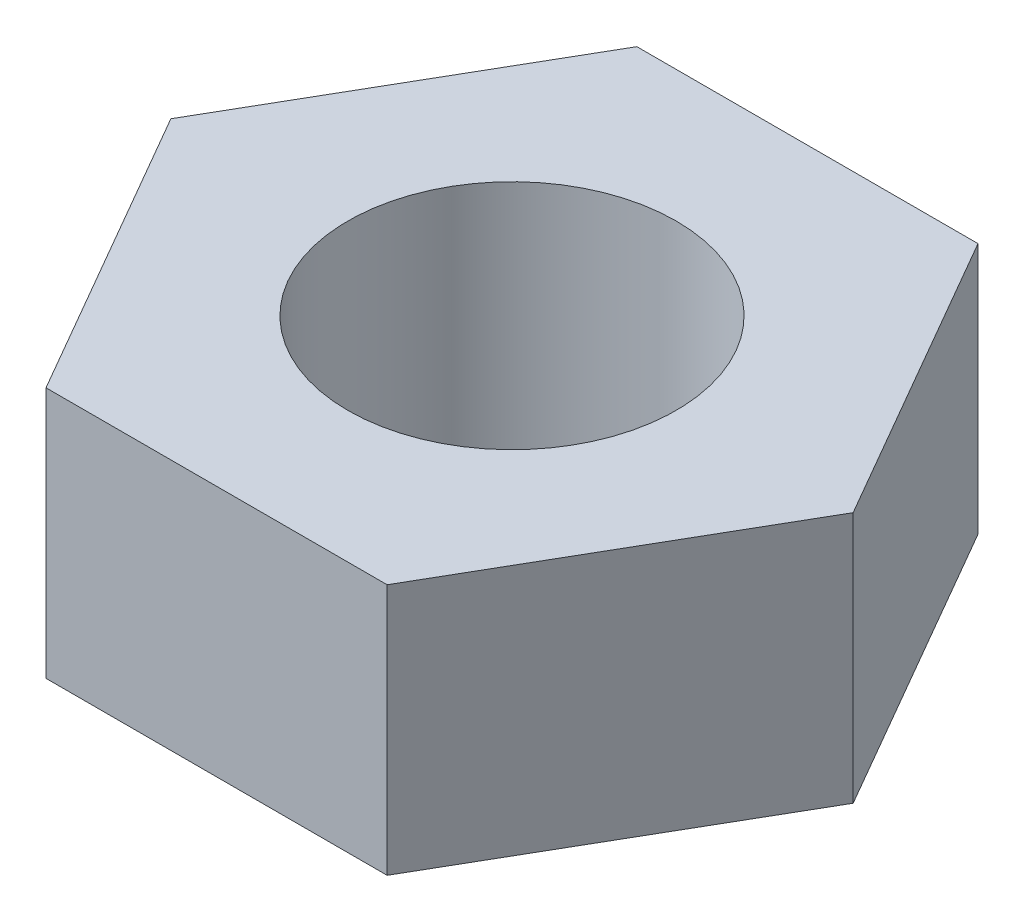
ISO-10303-21;
HEADER;
FILE_DESCRIPTION(('STEP AP214'),'2;1');
FILE_NAME('part.step','',(''),(''),'','','');
FILE_SCHEMA(('AUTOMOTIVE_DESIGN { 1 0 10303 214 1 1 1 1 }'));
ENDSEC;
DATA;
#1=APPLICATION_CONTEXT('core data for automotive mechanical design processes');
#2=APPLICATION_PROTOCOL_DEFINITION('international standard','automotive_design',2000,#1);
#3=PRODUCT_CONTEXT('',#1,'mechanical');
#4=PRODUCT('Part','Part','',(#3));
#5=PRODUCT_RELATED_PRODUCT_CATEGORY('part','',(#4));
#6=PRODUCT_DEFINITION_FORMATION('','',#4);
#7=PRODUCT_DEFINITION_CONTEXT('part definition',#1,'design');
#8=PRODUCT_DEFINITION('design','',#6,#7);
#9=PRODUCT_DEFINITION_SHAPE('','',#8);
#10=(LENGTH_UNIT() NAMED_UNIT(*) SI_UNIT(.MILLI.,.METRE.));
#11=(NAMED_UNIT(*) PLANE_ANGLE_UNIT() SI_UNIT($,.RADIAN.));
#12=(NAMED_UNIT(*) SI_UNIT($,.STERADIAN.) SOLID_ANGLE_UNIT());
#13=UNCERTAINTY_MEASURE_WITH_UNIT(LENGTH_MEASURE(1.E-05),#10,'distance_accuracy_value','');
#14=(GEOMETRIC_REPRESENTATION_CONTEXT(3) GLOBAL_UNCERTAINTY_ASSIGNED_CONTEXT((#13)) GLOBAL_UNIT_ASSIGNED_CONTEXT((#10,
#11,#12)) REPRESENTATION_CONTEXT('',''));
#15=CARTESIAN_POINT('',(0.,0.,0.));
#16=DIRECTION('',(0.,0.,1.));
#17=DIRECTION('',(1.,0.,0.));
#18=AXIS2_PLACEMENT_3D('',#15,#16,#17);
#19=CARTESIAN_POINT('',(0.,2.3,0.));
#20=DIRECTION('',(0.,1.,0.));
#21=DIRECTION('',(0.,0.,1.));
#22=AXIS2_PLACEMENT_3D('',#19,#20,#21);
#23=PLANE('',#22);
#24=DIRECTION('',(0.5,0.,-0.866025403784439));
#25=VECTOR('',#24,1.);
#26=CARTESIAN_POINT('',(1.55884572681199,2.3,2.7));
#27=LINE('',#26,#25);
#28=CARTESIAN_POINT('',(1.55884572681199,2.3,2.7));
#29=VERTEX_POINT('',#28);
#30=CARTESIAN_POINT('',(3.11769145362398,2.3,0.));
#31=VERTEX_POINT('',#30);
#32=EDGE_CURVE('E131',#29,#31,#27,.T.);
#33=ORIENTED_EDGE('',*,*,#32,.T.);
#34=DIRECTION('',(-0.5,0.,-0.866025403784439));
#35=VECTOR('',#34,1.);
#36=CARTESIAN_POINT('',(3.11769145362398,2.3,0.));
#37=LINE('',#36,#35);
#38=CARTESIAN_POINT('',(1.55884572681199,2.3,-2.70000000000001));
#39=VERTEX_POINT('',#38);
#40=EDGE_CURVE('E89',#31,#39,#37,.T.);
#41=ORIENTED_EDGE('',*,*,#40,.T.);
#42=DIRECTION('',(-1.,0.,0.));
#43=VECTOR('',#42,1.);
#44=CARTESIAN_POINT('',(1.55884572681199,2.3,-2.70000000000001));
#45=LINE('',#44,#43);
#46=CARTESIAN_POINT('',(-1.55884572681199,2.3,-2.70000000000001));
#47=VERTEX_POINT('',#46);
#48=EDGE_CURVE('E102',#39,#47,#45,.T.);
#49=ORIENTED_EDGE('',*,*,#48,.T.);
#50=DIRECTION('',(-0.5,0.,0.866025403784439));
#51=VECTOR('',#50,1.);
#52=CARTESIAN_POINT('',(-1.55884572681199,2.3,-2.70000000000001));
#53=LINE('',#52,#51);
#54=CARTESIAN_POINT('',(-3.11769145362398,2.3,0.));
#55=VERTEX_POINT('',#54);
#56=EDGE_CURVE('E96',#47,#55,#53,.T.);
#57=ORIENTED_EDGE('',*,*,#56,.T.);
#58=DIRECTION('',(0.5,0.,0.866025403784438));
#59=VECTOR('',#58,1.);
#60=CARTESIAN_POINT('',(-3.11769145362398,2.3,0.));
#61=LINE('',#60,#59);
#62=CARTESIAN_POINT('',(-1.55884572681199,2.3,2.7));
#63=VERTEX_POINT('',#62);
#64=EDGE_CURVE('E100',#55,#63,#61,.T.);
#65=ORIENTED_EDGE('',*,*,#64,.T.);
#66=DIRECTION('',(1.,0.,0.));
#67=VECTOR('',#66,1.);
#68=CARTESIAN_POINT('',(-1.55884572681199,2.3,2.7));
#69=LINE('',#68,#67);
#70=EDGE_CURVE('E52',#63,#29,#69,.T.);
#71=ORIENTED_EDGE('',*,*,#70,.T.);
#72=EDGE_LOOP('',(#33,#41,#49,#57,#65,#71));
#73=FACE_BOUND('',#72,.T.);
#74=CARTESIAN_POINT('',(0.,2.3,0.));
#75=DIRECTION('',(0.,1.,0.));
#76=DIRECTION('',(0.,0.,1.));
#77=AXIS2_PLACEMENT_3D('',#74,#75,#76);
#78=CIRCLE('',#77,1.5);
#79=CARTESIAN_POINT('',(0.,2.3,1.5));
#80=VERTEX_POINT('',#79);
#81=EDGE_CURVE('E124',#80,#80,#78,.T.);
#82=ORIENTED_EDGE('',*,*,#81,.F.);
#83=EDGE_LOOP('',(#82));
#84=FACE_BOUND('',#83,.T.);
#85=ADVANCED_FACE('F35',(#73,#84),#23,.T.);
#86=CARTESIAN_POINT('',(0.,0.,0.));
#87=DIRECTION('',(0.,1.,0.));
#88=DIRECTION('',(0.,0.,1.));
#89=AXIS2_PLACEMENT_3D('',#86,#87,#88);
#90=PLANE('',#89);
#91=DIRECTION('',(0.5,0.,-0.866025403784439));
#92=VECTOR('',#91,1.);
#93=CARTESIAN_POINT('',(1.55884572681199,0.,2.7));
#94=LINE('',#93,#92);
#95=CARTESIAN_POINT('',(1.55884572681199,0.,2.7));
#96=VERTEX_POINT('',#95);
#97=CARTESIAN_POINT('',(3.11769145362398,0.,0.));
#98=VERTEX_POINT('',#97);
#99=EDGE_CURVE('E120',#96,#98,#94,.T.);
#100=ORIENTED_EDGE('',*,*,#99,.F.);
#101=DIRECTION('',(1.,0.,0.));
#102=VECTOR('',#101,1.);
#103=CARTESIAN_POINT('',(-1.55884572681199,0.,2.7));
#104=LINE('',#103,#102);
#105=CARTESIAN_POINT('',(-1.55884572681199,0.,2.7));
#106=VERTEX_POINT('',#105);
#107=EDGE_CURVE('E81',#106,#96,#104,.T.);
#108=ORIENTED_EDGE('',*,*,#107,.F.);
#109=DIRECTION('',(0.5,0.,0.866025403784438));
#110=VECTOR('',#109,1.);
#111=CARTESIAN_POINT('',(-3.11769145362398,0.,0.));
#112=LINE('',#111,#110);
#113=CARTESIAN_POINT('',(-3.11769145362398,0.,0.));
#114=VERTEX_POINT('',#113);
#115=EDGE_CURVE('E75',#114,#106,#112,.T.);
#116=ORIENTED_EDGE('',*,*,#115,.F.);
#117=DIRECTION('',(-0.5,0.,0.866025403784439));
#118=VECTOR('',#117,1.);
#119=CARTESIAN_POINT('',(-1.55884572681199,0.,-2.70000000000001));
#120=LINE('',#119,#118);
#121=CARTESIAN_POINT('',(-1.55884572681199,0.,-2.70000000000001));
#122=VERTEX_POINT('',#121);
#123=EDGE_CURVE('E110',#122,#114,#120,.T.);
#124=ORIENTED_EDGE('',*,*,#123,.F.);
#125=DIRECTION('',(-1.,0.,0.));
#126=VECTOR('',#125,1.);
#127=CARTESIAN_POINT('',(1.55884572681199,0.,-2.70000000000001));
#128=LINE('',#127,#126);
#129=CARTESIAN_POINT('',(1.55884572681199,0.,-2.70000000000001));
#130=VERTEX_POINT('',#129);
#131=EDGE_CURVE('E126',#130,#122,#128,.T.);
#132=ORIENTED_EDGE('',*,*,#131,.F.);
#133=DIRECTION('',(-0.5,0.,-0.866025403784439));
#134=VECTOR('',#133,1.);
#135=CARTESIAN_POINT('',(3.11769145362398,0.,0.));
#136=LINE('',#135,#134);
#137=EDGE_CURVE('E123',#98,#130,#136,.T.);
#138=ORIENTED_EDGE('',*,*,#137,.F.);
#139=EDGE_LOOP('',(#100,#108,#116,#124,#132,#138));
#140=FACE_BOUND('',#139,.T.);
#141=CARTESIAN_POINT('',(0.,0.,0.));
#142=DIRECTION('',(0.,1.,0.));
#143=DIRECTION('',(0.,0.,1.));
#144=AXIS2_PLACEMENT_3D('',#141,#142,#143);
#145=CIRCLE('',#144,1.5);
#146=CARTESIAN_POINT('',(0.,0.,1.5));
#147=VERTEX_POINT('',#146);
#148=EDGE_CURVE('E224',#147,#147,#145,.T.);
#149=ORIENTED_EDGE('',*,*,#148,.T.);
#150=EDGE_LOOP('',(#149));
#151=FACE_BOUND('',#150,.T.);
#152=ADVANCED_FACE('F140',(#140,#151),#90,.F.);
#153=CARTESIAN_POINT('',(1.55884572681199,2.3,2.7));
#154=DIRECTION('',(-0.866025403784439,0.,-0.5));
#155=DIRECTION('',(-0.5,0.,0.866025403784439));
#156=AXIS2_PLACEMENT_3D('',#153,#154,#155);
#157=PLANE('',#156);
#158=ORIENTED_EDGE('',*,*,#99,.T.);
#159=DIRECTION('',(0.,-1.,0.));
#160=VECTOR('',#159,1.);
#161=CARTESIAN_POINT('',(3.11769145362398,2.3,0.));
#162=LINE('',#161,#160);
#163=EDGE_CURVE('E11',#31,#98,#162,.T.);
#164=ORIENTED_EDGE('',*,*,#163,.F.);
#165=ORIENTED_EDGE('',*,*,#32,.F.);
#166=DIRECTION('',(0.,-1.,0.));
#167=VECTOR('',#166,1.);
#168=CARTESIAN_POINT('',(1.55884572681199,2.3,2.7));
#169=LINE('',#168,#167);
#170=EDGE_CURVE('E116',#29,#96,#169,.T.);
#171=ORIENTED_EDGE('',*,*,#170,.T.);
#172=EDGE_LOOP('',(#158,#164,#165,#171));
#173=FACE_BOUND('',#172,.T.);
#174=ADVANCED_FACE('F37',(#173),#157,.F.);
#175=CARTESIAN_POINT('',(3.11769145362398,2.3,0.));
#176=DIRECTION('',(-0.866025403784439,0.,0.5));
#177=DIRECTION('',(0.5,0.,0.866025403784439));
#178=AXIS2_PLACEMENT_3D('',#175,#176,#177);
#179=PLANE('',#178);
#180=ORIENTED_EDGE('',*,*,#137,.T.);
#181=DIRECTION('',(0.,-1.,0.));
#182=VECTOR('',#181,1.);
#183=CARTESIAN_POINT('',(1.55884572681199,2.3,-2.70000000000001));
#184=LINE('',#183,#182);
#185=EDGE_CURVE('E44',#39,#130,#184,.T.);
#186=ORIENTED_EDGE('',*,*,#185,.F.);
#187=ORIENTED_EDGE('',*,*,#40,.F.);
#188=ORIENTED_EDGE('',*,*,#163,.T.);
#189=EDGE_LOOP('',(#180,#186,#187,#188));
#190=FACE_BOUND('',#189,.T.);
#191=ADVANCED_FACE('F165',(#190),#179,.F.);
#192=CARTESIAN_POINT('',(1.55884572681199,2.3,-2.70000000000001));
#193=DIRECTION('',(0.,0.,1.));
#194=DIRECTION('',(1.,0.,0.));
#195=AXIS2_PLACEMENT_3D('',#192,#193,#194);
#196=PLANE('',#195);
#197=ORIENTED_EDGE('',*,*,#131,.T.);
#198=DIRECTION('',(0.,-1.,0.));
#199=VECTOR('',#198,1.);
#200=CARTESIAN_POINT('',(-1.55884572681199,2.3,-2.70000000000001));
#201=LINE('',#200,#199);
#202=EDGE_CURVE('E111',#47,#122,#201,.T.);
#203=ORIENTED_EDGE('',*,*,#202,.F.);
#204=ORIENTED_EDGE('',*,*,#48,.F.);
#205=ORIENTED_EDGE('',*,*,#185,.T.);
#206=EDGE_LOOP('',(#197,#203,#204,#205));
#207=FACE_BOUND('',#206,.T.);
#208=ADVANCED_FACE('F137',(#207),#196,.F.);
#209=CARTESIAN_POINT('',(-1.55884572681199,2.3,-2.70000000000001));
#210=DIRECTION('',(0.866025403784439,0.,0.5));
#211=DIRECTION('',(0.5,0.,-0.866025403784439));
#212=AXIS2_PLACEMENT_3D('',#209,#210,#211);
#213=PLANE('',#212);
#214=ORIENTED_EDGE('',*,*,#123,.T.);
#215=DIRECTION('',(0.,-1.,0.));
#216=VECTOR('',#215,1.);
#217=CARTESIAN_POINT('',(-3.11769145362398,2.3,0.));
#218=LINE('',#217,#216);
#219=EDGE_CURVE('E107',#55,#114,#218,.T.);
#220=ORIENTED_EDGE('',*,*,#219,.F.);
#221=ORIENTED_EDGE('',*,*,#56,.F.);
#222=ORIENTED_EDGE('',*,*,#202,.T.);
#223=EDGE_LOOP('',(#214,#220,#221,#222));
#224=FACE_BOUND('',#223,.T.);
#225=ADVANCED_FACE('F108',(#224),#213,.F.);
#226=CARTESIAN_POINT('',(-3.11769145362398,2.3,0.));
#227=DIRECTION('',(0.866025403784439,0.,-0.5));
#228=DIRECTION('',(-0.5,0.,-0.866025403784439));
#229=AXIS2_PLACEMENT_3D('',#226,#227,#228);
#230=PLANE('',#229);
#231=ORIENTED_EDGE('',*,*,#115,.T.);
#232=DIRECTION('',(0.,-1.,0.));
#233=VECTOR('',#232,1.);
#234=CARTESIAN_POINT('',(-1.55884572681199,2.3,2.7));
#235=LINE('',#234,#233);
#236=EDGE_CURVE('E112',#63,#106,#235,.T.);
#237=ORIENTED_EDGE('',*,*,#236,.F.);
#238=ORIENTED_EDGE('',*,*,#64,.F.);
#239=ORIENTED_EDGE('',*,*,#219,.T.);
#240=EDGE_LOOP('',(#231,#237,#238,#239));
#241=FACE_BOUND('',#240,.T.);
#242=ADVANCED_FACE('F114',(#241),#230,.F.);
#243=CARTESIAN_POINT('',(-1.55884572681199,2.3,2.7));
#244=DIRECTION('',(0.,0.,-1.));
#245=DIRECTION('',(-1.,0.,0.));
#246=AXIS2_PLACEMENT_3D('',#243,#244,#245);
#247=PLANE('',#246);
#248=ORIENTED_EDGE('',*,*,#107,.T.);
#249=ORIENTED_EDGE('',*,*,#170,.F.);
#250=ORIENTED_EDGE('',*,*,#70,.F.);
#251=ORIENTED_EDGE('',*,*,#236,.T.);
#252=EDGE_LOOP('',(#248,#249,#250,#251));
#253=FACE_BOUND('',#252,.T.);
#254=ADVANCED_FACE('F145',(#253),#247,.F.);
#255=CARTESIAN_POINT('',(0.,2.3,0.));
#256=DIRECTION('',(0.,-1.,0.));
#257=DIRECTION('',(0.,0.,-1.));
#258=AXIS2_PLACEMENT_3D('',#255,#256,#257);
#259=CYLINDRICAL_SURFACE('',#258,1.5);
#260=ORIENTED_EDGE('',*,*,#81,.T.);
#261=EDGE_LOOP('',(#260));
#262=FACE_BOUND('',#261,.T.);
#263=ORIENTED_EDGE('',*,*,#148,.F.);
#264=EDGE_LOOP('',(#263));
#265=FACE_BOUND('',#264,.T.);
#266=ADVANCED_FACE('F147',(#262,#265),#259,.F.);
#267=CLOSED_SHELL('',(#85,#152,#174,#191,#208,#225,#242,#254,#266));
#268=MANIFOLD_SOLID_BREP('B2',#267);
#269=ADVANCED_BREP_SHAPE_REPRESENTATION('',(#18,#268),#14);
#270=SHAPE_DEFINITION_REPRESENTATION(#9,#269);
ENDSEC;
END-ISO-10303-21;
